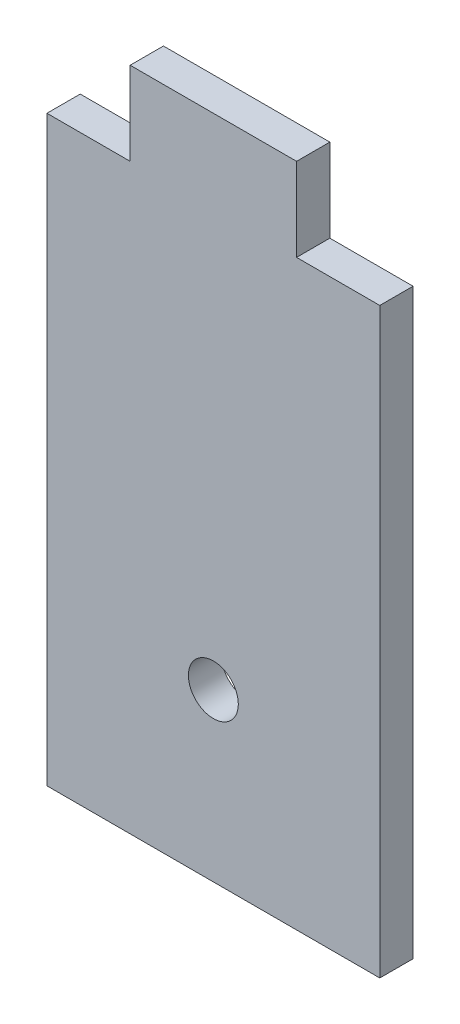
ISO-10303-21;
HEADER;
FILE_DESCRIPTION(('STEP AP214'),'2;1');
FILE_NAME('part.step','',(''),(''),'','','');
FILE_SCHEMA(('AUTOMOTIVE_DESIGN { 1 0 10303 214 1 1 1 1 }'));
ENDSEC;
DATA;
#1=APPLICATION_CONTEXT('core data for automotive mechanical design processes');
#2=APPLICATION_PROTOCOL_DEFINITION('international standard','automotive_design',2000,#1);
#3=PRODUCT_CONTEXT('',#1,'mechanical');
#4=PRODUCT('Part','Part','',(#3));
#5=PRODUCT_RELATED_PRODUCT_CATEGORY('part','',(#4));
#6=PRODUCT_DEFINITION_FORMATION('','',#4);
#7=PRODUCT_DEFINITION_CONTEXT('part definition',#1,'design');
#8=PRODUCT_DEFINITION('design','',#6,#7);
#9=PRODUCT_DEFINITION_SHAPE('','',#8);
#10=(LENGTH_UNIT() NAMED_UNIT(*) SI_UNIT(.MILLI.,.METRE.));
#11=(NAMED_UNIT(*) PLANE_ANGLE_UNIT() SI_UNIT($,.RADIAN.));
#12=(NAMED_UNIT(*) SI_UNIT($,.STERADIAN.) SOLID_ANGLE_UNIT());
#13=UNCERTAINTY_MEASURE_WITH_UNIT(LENGTH_MEASURE(1.E-05),#10,'distance_accuracy_value','');
#14=(GEOMETRIC_REPRESENTATION_CONTEXT(3) GLOBAL_UNCERTAINTY_ASSIGNED_CONTEXT((#13)) GLOBAL_UNIT_ASSIGNED_CONTEXT((#10,
#11,#12)) REPRESENTATION_CONTEXT('',''));
#15=CARTESIAN_POINT('',(0.,0.,0.));
#16=DIRECTION('',(0.,0.,1.));
#17=DIRECTION('',(1.,0.,0.));
#18=AXIS2_PLACEMENT_3D('',#15,#16,#17);
#19=CARTESIAN_POINT('',(0.,0.,2.));
#20=DIRECTION('',(0.,0.,1.));
#21=DIRECTION('',(1.,0.,0.));
#22=AXIS2_PLACEMENT_3D('',#19,#20,#21);
#23=PLANE('',#22);
#24=DIRECTION('',(0.,1.,0.));
#25=VECTOR('',#24,1.);
#26=CARTESIAN_POINT('',(-1.99220923761826,17.5581395348837,2.));
#27=LINE('',#26,#25);
#28=CARTESIAN_POINT('',(-1.99220923761826,-17.4418604651163,2.));
#29=VERTEX_POINT('',#28);
#30=CARTESIAN_POINT('',(-1.99220923761826,17.5581395348837,2.));
#31=VERTEX_POINT('',#30);
#32=EDGE_CURVE('E145',#29,#31,#27,.T.);
#33=ORIENTED_EDGE('',*,*,#32,.T.);
#34=DIRECTION('',(-1.,0.,0.));
#35=VECTOR('',#34,1.);
#36=CARTESIAN_POINT('',(-6.99220923761826,17.5581395348837,2.));
#37=LINE('',#36,#35);
#38=CARTESIAN_POINT('',(-6.99220923761826,17.5581395348837,2.));
#39=VERTEX_POINT('',#38);
#40=EDGE_CURVE('E93',#31,#39,#37,.T.);
#41=ORIENTED_EDGE('',*,*,#40,.T.);
#42=DIRECTION('',(0.,1.,0.));
#43=VECTOR('',#42,1.);
#44=CARTESIAN_POINT('',(-6.99220923761826,22.5581395348837,2.));
#45=LINE('',#44,#43);
#46=CARTESIAN_POINT('',(-6.99220923761826,22.5581395348837,2.));
#47=VERTEX_POINT('',#46);
#48=EDGE_CURVE('E160',#39,#47,#45,.T.);
#49=ORIENTED_EDGE('',*,*,#48,.T.);
#50=DIRECTION('',(-1.,0.,0.));
#51=VECTOR('',#50,1.);
#52=CARTESIAN_POINT('',(-16.9922092376183,22.5581395348837,2.));
#53=LINE('',#52,#51);
#54=CARTESIAN_POINT('',(-16.9922092376183,22.5581395348837,2.));
#55=VERTEX_POINT('',#54);
#56=EDGE_CURVE('E173',#47,#55,#53,.T.);
#57=ORIENTED_EDGE('',*,*,#56,.T.);
#58=DIRECTION('',(0.,-1.,0.));
#59=VECTOR('',#58,1.);
#60=CARTESIAN_POINT('',(-16.9922092376183,22.5581395348837,2.));
#61=LINE('',#60,#59);
#62=CARTESIAN_POINT('',(-16.9922092376183,17.5581395348837,2.));
#63=VERTEX_POINT('',#62);
#64=EDGE_CURVE('E112',#55,#63,#61,.T.);
#65=ORIENTED_EDGE('',*,*,#64,.T.);
#66=DIRECTION('',(-1.,0.,0.));
#67=VECTOR('',#66,1.);
#68=CARTESIAN_POINT('',(-16.9922092376183,17.5581395348837,2.));
#69=LINE('',#68,#67);
#70=CARTESIAN_POINT('',(-21.9922092376183,17.5581395348837,2.));
#71=VERTEX_POINT('',#70);
#72=EDGE_CURVE('E106',#63,#71,#69,.T.);
#73=ORIENTED_EDGE('',*,*,#72,.T.);
#74=DIRECTION('',(0.,-1.,0.));
#75=VECTOR('',#74,1.);
#76=CARTESIAN_POINT('',(-21.9922092376183,17.5581395348837,2.));
#77=LINE('',#76,#75);
#78=CARTESIAN_POINT('',(-21.9922092376183,-17.4418604651163,2.));
#79=VERTEX_POINT('',#78);
#80=EDGE_CURVE('E110',#71,#79,#77,.T.);
#81=ORIENTED_EDGE('',*,*,#80,.T.);
#82=DIRECTION('',(1.,0.,0.));
#83=VECTOR('',#82,1.);
#84=CARTESIAN_POINT('',(-21.9922092376183,-17.4418604651163,2.));
#85=LINE('',#84,#83);
#86=EDGE_CURVE('E50',#79,#29,#85,.T.);
#87=ORIENTED_EDGE('',*,*,#86,.T.);
#88=EDGE_LOOP('',(#33,#41,#49,#57,#65,#73,#81,#87));
#89=FACE_BOUND('',#88,.T.);
#90=CARTESIAN_POINT('',(-11.9922092376183,-7.44186046511627,2.));
#91=DIRECTION('',(0.,0.,1.));
#92=DIRECTION('',(1.,0.,0.));
#93=AXIS2_PLACEMENT_3D('',#90,#91,#92);
#94=CIRCLE('',#93,1.5);
#95=CARTESIAN_POINT('',(-10.4922092376183,-7.44186046511627,2.));
#96=VERTEX_POINT('',#95);
#97=EDGE_CURVE('E134',#96,#96,#94,.T.);
#98=ORIENTED_EDGE('',*,*,#97,.F.);
#99=EDGE_LOOP('',(#98));
#100=FACE_BOUND('',#99,.T.);
#101=ADVANCED_FACE('F33',(#89,#100),#23,.T.);
#102=CARTESIAN_POINT('',(0.,0.,0.));
#103=DIRECTION('',(0.,0.,1.));
#104=DIRECTION('',(1.,0.,0.));
#105=AXIS2_PLACEMENT_3D('',#102,#103,#104);
#106=PLANE('',#105);
#107=DIRECTION('',(0.,1.,0.));
#108=VECTOR('',#107,1.);
#109=CARTESIAN_POINT('',(-1.99220923761826,17.5581395348837,0.));
#110=LINE('',#109,#108);
#111=CARTESIAN_POINT('',(-1.99220923761826,-17.4418604651163,0.));
#112=VERTEX_POINT('',#111);
#113=CARTESIAN_POINT('',(-1.99220923761826,17.5581395348837,0.));
#114=VERTEX_POINT('',#113);
#115=EDGE_CURVE('E130',#112,#114,#110,.T.);
#116=ORIENTED_EDGE('',*,*,#115,.F.);
#117=DIRECTION('',(1.,0.,0.));
#118=VECTOR('',#117,1.);
#119=CARTESIAN_POINT('',(-21.9922092376183,-17.4418604651163,0.));
#120=LINE('',#119,#118);
#121=CARTESIAN_POINT('',(-21.9922092376183,-17.4418604651163,0.));
#122=VERTEX_POINT('',#121);
#123=EDGE_CURVE('E85',#122,#112,#120,.T.);
#124=ORIENTED_EDGE('',*,*,#123,.F.);
#125=DIRECTION('',(0.,-1.,0.));
#126=VECTOR('',#125,1.);
#127=CARTESIAN_POINT('',(-21.9922092376183,17.5581395348837,0.));
#128=LINE('',#127,#126);
#129=CARTESIAN_POINT('',(-21.9922092376183,17.5581395348837,0.));
#130=VERTEX_POINT('',#129);
#131=EDGE_CURVE('E79',#130,#122,#128,.T.);
#132=ORIENTED_EDGE('',*,*,#131,.F.);
#133=DIRECTION('',(-1.,0.,0.));
#134=VECTOR('',#133,1.);
#135=CARTESIAN_POINT('',(-16.9922092376183,17.5581395348837,0.));
#136=LINE('',#135,#134);
#137=CARTESIAN_POINT('',(-16.9922092376183,17.5581395348837,0.));
#138=VERTEX_POINT('',#137);
#139=EDGE_CURVE('E120',#138,#130,#136,.T.);
#140=ORIENTED_EDGE('',*,*,#139,.F.);
#141=DIRECTION('',(0.,-1.,0.));
#142=VECTOR('',#141,1.);
#143=CARTESIAN_POINT('',(-16.9922092376183,22.5581395348837,0.));
#144=LINE('',#143,#142);
#145=CARTESIAN_POINT('',(-16.9922092376183,22.5581395348837,0.));
#146=VERTEX_POINT('',#145);
#147=EDGE_CURVE('E140',#146,#138,#144,.T.);
#148=ORIENTED_EDGE('',*,*,#147,.F.);
#149=DIRECTION('',(-1.,0.,0.));
#150=VECTOR('',#149,1.);
#151=CARTESIAN_POINT('',(-16.9922092376183,22.5581395348837,0.));
#152=LINE('',#151,#150);
#153=CARTESIAN_POINT('',(-6.99220923761826,22.5581395348837,0.));
#154=VERTEX_POINT('',#153);
#155=EDGE_CURVE('E138',#154,#146,#152,.T.);
#156=ORIENTED_EDGE('',*,*,#155,.F.);
#157=DIRECTION('',(0.,1.,0.));
#158=VECTOR('',#157,1.);
#159=CARTESIAN_POINT('',(-6.99220923761826,22.5581395348837,0.));
#160=LINE('',#159,#158);
#161=CARTESIAN_POINT('',(-6.99220923761826,17.5581395348837,0.));
#162=VERTEX_POINT('',#161);
#163=EDGE_CURVE('E136',#162,#154,#160,.T.);
#164=ORIENTED_EDGE('',*,*,#163,.F.);
#165=DIRECTION('',(-1.,0.,0.));
#166=VECTOR('',#165,1.);
#167=CARTESIAN_POINT('',(-6.99220923761826,17.5581395348837,0.));
#168=LINE('',#167,#166);
#169=EDGE_CURVE('E133',#114,#162,#168,.T.);
#170=ORIENTED_EDGE('',*,*,#169,.F.);
#171=EDGE_LOOP('',(#116,#124,#132,#140,#148,#156,#164,#170));
#172=FACE_BOUND('',#171,.T.);
#173=CARTESIAN_POINT('',(-11.9922092376183,-7.44186046511627,0.));
#174=DIRECTION('',(0.,0.,1.));
#175=DIRECTION('',(1.,0.,0.));
#176=AXIS2_PLACEMENT_3D('',#173,#174,#175);
#177=CIRCLE('',#176,1.5);
#178=CARTESIAN_POINT('',(-10.4922092376183,-7.44186046511627,0.));
#179=VERTEX_POINT('',#178);
#180=EDGE_CURVE('E179',#179,#179,#177,.T.);
#181=ORIENTED_EDGE('',*,*,#180,.T.);
#182=EDGE_LOOP('',(#181));
#183=FACE_BOUND('',#182,.T.);
#184=ADVANCED_FACE('F164',(#172,#183),#106,.F.);
#185=CARTESIAN_POINT('',(-1.99220923761826,17.5581395348837,2.));
#186=DIRECTION('',(-1.,0.,0.));
#187=DIRECTION('',(0.,-1.,0.));
#188=AXIS2_PLACEMENT_3D('',#185,#186,#187);
#189=PLANE('',#188);
#190=ORIENTED_EDGE('',*,*,#115,.T.);
#191=DIRECTION('',(0.,0.,-1.));
#192=VECTOR('',#191,1.);
#193=CARTESIAN_POINT('',(-1.99220923761826,17.5581395348837,2.));
#194=LINE('',#193,#192);
#195=EDGE_CURVE('E11',#31,#114,#194,.T.);
#196=ORIENTED_EDGE('',*,*,#195,.F.);
#197=ORIENTED_EDGE('',*,*,#32,.F.);
#198=DIRECTION('',(0.,0.,-1.));
#199=VECTOR('',#198,1.);
#200=CARTESIAN_POINT('',(-1.99220923761826,-17.4418604651163,2.));
#201=LINE('',#200,#199);
#202=EDGE_CURVE('E126',#29,#112,#201,.T.);
#203=ORIENTED_EDGE('',*,*,#202,.T.);
#204=EDGE_LOOP('',(#190,#196,#197,#203));
#205=FACE_BOUND('',#204,.T.);
#206=ADVANCED_FACE('F35',(#205),#189,.F.);
#207=CARTESIAN_POINT('',(-6.99220923761826,17.5581395348837,2.));
#208=DIRECTION('',(0.,-1.,0.));
#209=DIRECTION('',(0.,0.,-1.));
#210=AXIS2_PLACEMENT_3D('',#207,#208,#209);
#211=PLANE('',#210);
#212=ORIENTED_EDGE('',*,*,#169,.T.);
#213=DIRECTION('',(0.,0.,-1.));
#214=VECTOR('',#213,1.);
#215=CARTESIAN_POINT('',(-6.99220923761826,17.5581395348837,2.));
#216=LINE('',#215,#214);
#217=EDGE_CURVE('E42',#39,#162,#216,.T.);
#218=ORIENTED_EDGE('',*,*,#217,.F.);
#219=ORIENTED_EDGE('',*,*,#40,.F.);
#220=ORIENTED_EDGE('',*,*,#195,.T.);
#221=EDGE_LOOP('',(#212,#218,#219,#220));
#222=FACE_BOUND('',#221,.T.);
#223=ADVANCED_FACE('F207',(#222),#211,.F.);
#224=CARTESIAN_POINT('',(-6.99220923761826,22.5581395348837,2.));
#225=DIRECTION('',(-1.,0.,0.));
#226=DIRECTION('',(0.,-1.,0.));
#227=AXIS2_PLACEMENT_3D('',#224,#225,#226);
#228=PLANE('',#227);
#229=ORIENTED_EDGE('',*,*,#163,.T.);
#230=DIRECTION('',(0.,0.,-1.));
#231=VECTOR('',#230,1.);
#232=CARTESIAN_POINT('',(-6.99220923761826,22.5581395348837,2.));
#233=LINE('',#232,#231);
#234=EDGE_CURVE('E152',#47,#154,#233,.T.);
#235=ORIENTED_EDGE('',*,*,#234,.F.);
#236=ORIENTED_EDGE('',*,*,#48,.F.);
#237=ORIENTED_EDGE('',*,*,#217,.T.);
#238=EDGE_LOOP('',(#229,#235,#236,#237));
#239=FACE_BOUND('',#238,.T.);
#240=ADVANCED_FACE('F158',(#239),#228,.F.);
#241=CARTESIAN_POINT('',(-16.9922092376183,22.5581395348837,2.));
#242=DIRECTION('',(0.,-1.,0.));
#243=DIRECTION('',(0.,0.,-1.));
#244=AXIS2_PLACEMENT_3D('',#241,#242,#243);
#245=PLANE('',#244);
#246=ORIENTED_EDGE('',*,*,#155,.T.);
#247=DIRECTION('',(0.,0.,-1.));
#248=VECTOR('',#247,1.);
#249=CARTESIAN_POINT('',(-16.9922092376183,22.5581395348837,2.));
#250=LINE('',#249,#248);
#251=EDGE_CURVE('E149',#55,#146,#250,.T.);
#252=ORIENTED_EDGE('',*,*,#251,.F.);
#253=ORIENTED_EDGE('',*,*,#56,.F.);
#254=ORIENTED_EDGE('',*,*,#234,.T.);
#255=EDGE_LOOP('',(#246,#252,#253,#254));
#256=FACE_BOUND('',#255,.T.);
#257=ADVANCED_FACE('F169',(#256),#245,.F.);
#258=CARTESIAN_POINT('',(-16.9922092376183,22.5581395348837,2.));
#259=DIRECTION('',(1.,0.,0.));
#260=DIRECTION('',(0.,1.,0.));
#261=AXIS2_PLACEMENT_3D('',#258,#259,#260);
#262=PLANE('',#261);
#263=ORIENTED_EDGE('',*,*,#147,.T.);
#264=DIRECTION('',(0.,0.,-1.));
#265=VECTOR('',#264,1.);
#266=CARTESIAN_POINT('',(-16.9922092376183,17.5581395348837,2.));
#267=LINE('',#266,#265);
#268=EDGE_CURVE('E121',#63,#138,#267,.T.);
#269=ORIENTED_EDGE('',*,*,#268,.F.);
#270=ORIENTED_EDGE('',*,*,#64,.F.);
#271=ORIENTED_EDGE('',*,*,#251,.T.);
#272=EDGE_LOOP('',(#263,#269,#270,#271));
#273=FACE_BOUND('',#272,.T.);
#274=ADVANCED_FACE('F172',(#273),#262,.F.);
#275=CARTESIAN_POINT('',(-16.9922092376183,17.5581395348837,2.));
#276=DIRECTION('',(0.,-1.,0.));
#277=DIRECTION('',(0.,0.,-1.));
#278=AXIS2_PLACEMENT_3D('',#275,#276,#277);
#279=PLANE('',#278);
#280=ORIENTED_EDGE('',*,*,#139,.T.);
#281=DIRECTION('',(0.,0.,-1.));
#282=VECTOR('',#281,1.);
#283=CARTESIAN_POINT('',(-21.9922092376183,17.5581395348837,2.));
#284=LINE('',#283,#282);
#285=EDGE_CURVE('E117',#71,#130,#284,.T.);
#286=ORIENTED_EDGE('',*,*,#285,.F.);
#287=ORIENTED_EDGE('',*,*,#72,.F.);
#288=ORIENTED_EDGE('',*,*,#268,.T.);
#289=EDGE_LOOP('',(#280,#286,#287,#288));
#290=FACE_BOUND('',#289,.T.);
#291=ADVANCED_FACE('F118',(#290),#279,.F.);
#292=CARTESIAN_POINT('',(-21.9922092376183,17.5581395348837,2.));
#293=DIRECTION('',(1.,0.,0.));
#294=DIRECTION('',(0.,1.,0.));
#295=AXIS2_PLACEMENT_3D('',#292,#293,#294);
#296=PLANE('',#295);
#297=ORIENTED_EDGE('',*,*,#131,.T.);
#298=DIRECTION('',(0.,0.,-1.));
#299=VECTOR('',#298,1.);
#300=CARTESIAN_POINT('',(-21.9922092376183,-17.4418604651163,2.));
#301=LINE('',#300,#299);
#302=EDGE_CURVE('E122',#79,#122,#301,.T.);
#303=ORIENTED_EDGE('',*,*,#302,.F.);
#304=ORIENTED_EDGE('',*,*,#80,.F.);
#305=ORIENTED_EDGE('',*,*,#285,.T.);
#306=EDGE_LOOP('',(#297,#303,#304,#305));
#307=FACE_BOUND('',#306,.T.);
#308=ADVANCED_FACE('F124',(#307),#296,.F.);
#309=CARTESIAN_POINT('',(-21.9922092376183,-17.4418604651163,2.));
#310=DIRECTION('',(0.,1.,0.));
#311=DIRECTION('',(0.,0.,1.));
#312=AXIS2_PLACEMENT_3D('',#309,#310,#311);
#313=PLANE('',#312);
#314=ORIENTED_EDGE('',*,*,#123,.T.);
#315=ORIENTED_EDGE('',*,*,#202,.F.);
#316=ORIENTED_EDGE('',*,*,#86,.F.);
#317=ORIENTED_EDGE('',*,*,#302,.T.);
#318=EDGE_LOOP('',(#314,#315,#316,#317));
#319=FACE_BOUND('',#318,.T.);
#320=ADVANCED_FACE('F195',(#319),#313,.F.);
#321=CARTESIAN_POINT('',(-11.9922092376183,-7.44186046511627,2.));
#322=DIRECTION('',(0.,0.,-1.));
#323=DIRECTION('',(-1.,0.,0.));
#324=AXIS2_PLACEMENT_3D('',#321,#322,#323);
#325=CYLINDRICAL_SURFACE('',#324,1.5);
#326=ORIENTED_EDGE('',*,*,#97,.T.);
#327=EDGE_LOOP('',(#326));
#328=FACE_BOUND('',#327,.T.);
#329=ORIENTED_EDGE('',*,*,#180,.F.);
#330=EDGE_LOOP('',(#329));
#331=FACE_BOUND('',#330,.T.);
#332=ADVANCED_FACE('F185',(#328,#331),#325,.F.);
#333=CLOSED_SHELL('',(#101,#184,#206,#223,#240,#257,#274,#291,#308,#320,#332));
#334=MANIFOLD_SOLID_BREP('B2',#333);
#335=ADVANCED_BREP_SHAPE_REPRESENTATION('',(#18,#334),#14);
#336=SHAPE_DEFINITION_REPRESENTATION(#9,#335);
ENDSEC;
END-ISO-10303-21;
